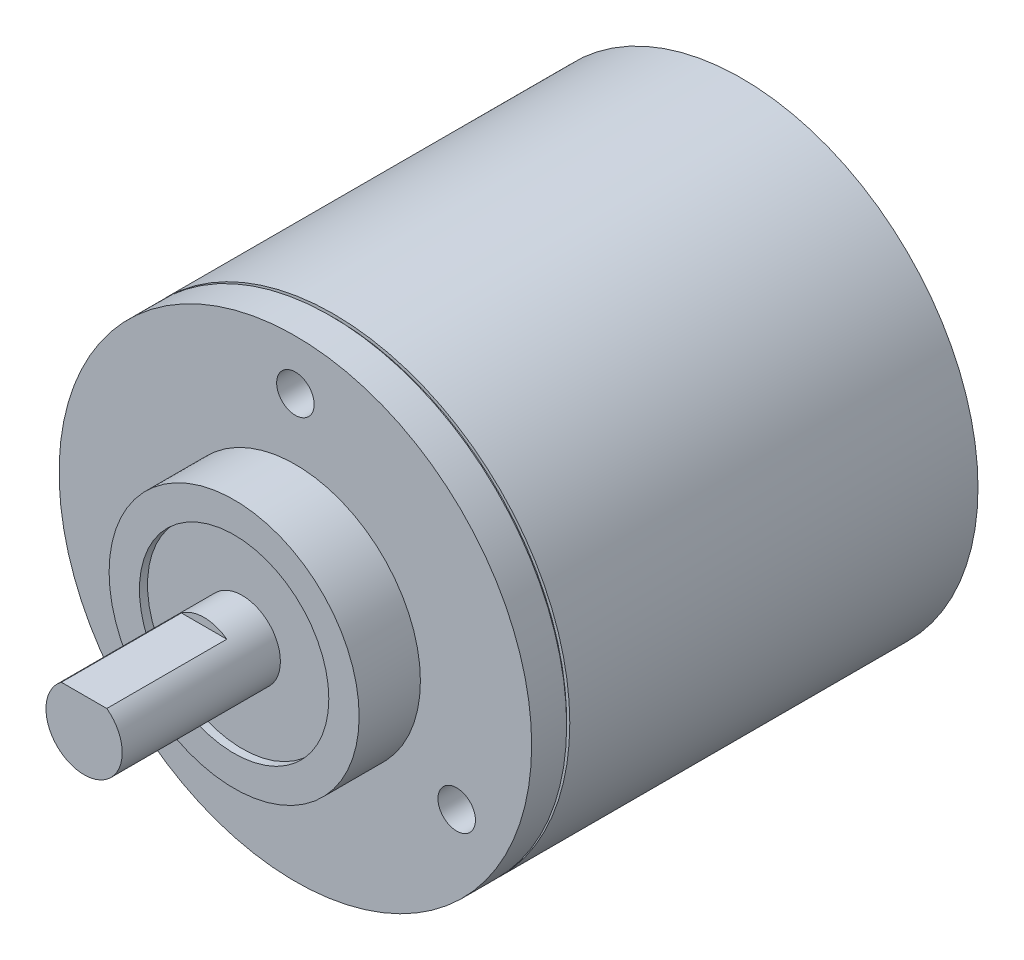
ISO-10303-21;
HEADER;
FILE_DESCRIPTION(('STEP AP214'),'2;1');
FILE_NAME('part.step','',(''),(''),'','','');
FILE_SCHEMA(('AUTOMOTIVE_DESIGN { 1 0 10303 214 1 1 1 1 }'));
ENDSEC;
DATA;
#1=APPLICATION_CONTEXT('core data for automotive mechanical design processes');
#2=APPLICATION_PROTOCOL_DEFINITION('international standard','automotive_design',2000,#1);
#3=PRODUCT_CONTEXT('',#1,'mechanical');
#4=PRODUCT('Part','Part','',(#3));
#5=PRODUCT_RELATED_PRODUCT_CATEGORY('part','',(#4));
#6=PRODUCT_DEFINITION_FORMATION('','',#4);
#7=PRODUCT_DEFINITION_CONTEXT('part definition',#1,'design');
#8=PRODUCT_DEFINITION('design','',#6,#7);
#9=PRODUCT_DEFINITION_SHAPE('','',#8);
#10=(LENGTH_UNIT() NAMED_UNIT(*) SI_UNIT(.MILLI.,.METRE.));
#11=(NAMED_UNIT(*) PLANE_ANGLE_UNIT() SI_UNIT($,.RADIAN.));
#12=(NAMED_UNIT(*) SI_UNIT($,.STERADIAN.) SOLID_ANGLE_UNIT());
#13=UNCERTAINTY_MEASURE_WITH_UNIT(LENGTH_MEASURE(1.E-05),#10,'distance_accuracy_value','');
#14=(GEOMETRIC_REPRESENTATION_CONTEXT(3) GLOBAL_UNCERTAINTY_ASSIGNED_CONTEXT((#13)) GLOBAL_UNIT_ASSIGNED_CONTEXT((#10,
#11,#12)) REPRESENTATION_CONTEXT('',''));
#15=CARTESIAN_POINT('',(0.,0.,0.));
#16=DIRECTION('',(0.,0.,1.));
#17=DIRECTION('',(1.,0.,0.));
#18=AXIS2_PLACEMENT_3D('',#15,#16,#17);
#19=CARTESIAN_POINT('',(0.,0.,-0.1));
#20=DIRECTION('',(0.,0.,1.));
#21=DIRECTION('',(1.,0.,0.));
#22=AXIS2_PLACEMENT_3D('',#19,#20,#21);
#23=CYLINDRICAL_SURFACE('',#22,18.9);
#24=CARTESIAN_POINT('',(0.,0.,32.8));
#25=DIRECTION('',(0.,0.,1.));
#26=DIRECTION('',(1.,0.,0.));
#27=AXIS2_PLACEMENT_3D('',#24,#25,#26);
#28=CIRCLE('',#27,18.9);
#29=CARTESIAN_POINT('',(18.9,0.,32.8));
#30=VERTEX_POINT('',#29);
#31=EDGE_CURVE('E40',#30,#30,#28,.F.);
#32=ORIENTED_EDGE('',*,*,#31,.F.);
#33=EDGE_LOOP('',(#32));
#34=FACE_BOUND('',#33,.T.);
#35=CARTESIAN_POINT('',(0.,0.,35.6));
#36=DIRECTION('',(0.,0.,1.));
#37=DIRECTION('',(1.,0.,0.));
#38=AXIS2_PLACEMENT_3D('',#35,#36,#37);
#39=CIRCLE('',#38,18.9);
#40=CARTESIAN_POINT('',(18.9,0.,35.6));
#41=VERTEX_POINT('',#40);
#42=EDGE_CURVE('E81',#41,#41,#39,.T.);
#43=ORIENTED_EDGE('',*,*,#42,.F.);
#44=EDGE_LOOP('',(#43));
#45=FACE_BOUND('',#44,.T.);
#46=ADVANCED_FACE('F36',(#34,#45),#23,.T.);
#47=CARTESIAN_POINT('',(0.,0.,35.6));
#48=DIRECTION('',(0.,0.,1.));
#49=DIRECTION('',(1.,0.,0.));
#50=AXIS2_PLACEMENT_3D('',#47,#48,#49);
#51=PLANE('',#50);
#52=CARTESIAN_POINT('',(-12.9037785163881,-7.45000000000006,35.6));
#53=DIRECTION('',(0.,0.,1.));
#54=DIRECTION('',(-0.500000000000004,0.866025403784436,0.));
#55=AXIS2_PLACEMENT_3D('',#52,#53,#54);
#56=CIRCLE('',#55,1.5);
#57=CARTESIAN_POINT('',(-13.6537785163881,-6.15096189432341,35.6));
#58=VERTEX_POINT('',#57);
#59=EDGE_CURVE('E114',#58,#58,#56,.T.);
#60=ORIENTED_EDGE('',*,*,#59,.F.);
#61=EDGE_LOOP('',(#60));
#62=FACE_BOUND('',#61,.T.);
#63=CARTESIAN_POINT('',(12.9037785163882,-7.44999999999988,35.6));
#64=DIRECTION('',(0.,0.,1.));
#65=DIRECTION('',(-0.499999999999992,-0.866025403784443,0.));
#66=AXIS2_PLACEMENT_3D('',#63,#64,#65);
#67=CIRCLE('',#66,1.5);
#68=CARTESIAN_POINT('',(12.1537785163882,-8.74903810567655,35.6));
#69=VERTEX_POINT('',#68);
#70=EDGE_CURVE('E103',#69,#69,#67,.T.);
#71=ORIENTED_EDGE('',*,*,#70,.F.);
#72=EDGE_LOOP('',(#71));
#73=FACE_BOUND('',#72,.T.);
#74=CARTESIAN_POINT('',(0.,14.9,35.6));
#75=DIRECTION('',(0.,0.,1.));
#76=DIRECTION('',(1.,0.,0.));
#77=AXIS2_PLACEMENT_3D('',#74,#75,#76);
#78=CIRCLE('',#77,1.5);
#79=CARTESIAN_POINT('',(1.5,14.9,35.6));
#80=VERTEX_POINT('',#79);
#81=EDGE_CURVE('E84',#80,#80,#78,.T.);
#82=ORIENTED_EDGE('',*,*,#81,.F.);
#83=EDGE_LOOP('',(#82));
#84=FACE_BOUND('',#83,.T.);
#85=CARTESIAN_POINT('',(0.,0.,35.6));
#86=DIRECTION('',(0.,0.,1.));
#87=DIRECTION('',(1.,0.,0.));
#88=AXIS2_PLACEMENT_3D('',#85,#86,#87);
#89=CIRCLE('',#88,10.);
#90=CARTESIAN_POINT('',(10.,0.,35.6));
#91=VERTEX_POINT('',#90);
#92=EDGE_CURVE('E88',#91,#91,#89,.T.);
#93=ORIENTED_EDGE('',*,*,#92,.F.);
#94=EDGE_LOOP('',(#93));
#95=FACE_BOUND('',#94,.T.);
#96=ORIENTED_EDGE('',*,*,#42,.T.);
#97=EDGE_LOOP('',(#96));
#98=FACE_BOUND('',#97,.T.);
#99=ADVANCED_FACE('F145',(#62,#73,#84,#95,#98),#51,.T.);
#100=CARTESIAN_POINT('',(0.,0.,40.5));
#101=DIRECTION('',(0.,0.,-1.));
#102=DIRECTION('',(-1.,0.,0.));
#103=AXIS2_PLACEMENT_3D('',#100,#101,#102);
#104=CYLINDRICAL_SURFACE('',#103,10.);
#105=CARTESIAN_POINT('',(0.,0.,40.5));
#106=DIRECTION('',(0.,0.,1.));
#107=DIRECTION('',(1.,0.,0.));
#108=AXIS2_PLACEMENT_3D('',#105,#106,#107);
#109=CIRCLE('',#108,10.);
#110=CARTESIAN_POINT('',(10.,0.,40.5));
#111=VERTEX_POINT('',#110);
#112=EDGE_CURVE('E77',#111,#111,#109,.T.);
#113=ORIENTED_EDGE('',*,*,#112,.F.);
#114=EDGE_LOOP('',(#113));
#115=FACE_BOUND('',#114,.T.);
#116=ORIENTED_EDGE('',*,*,#92,.T.);
#117=EDGE_LOOP('',(#116));
#118=FACE_BOUND('',#117,.T.);
#119=ADVANCED_FACE('F139',(#115,#118),#104,.T.);
#120=CARTESIAN_POINT('',(0.,0.,40.5));
#121=DIRECTION('',(0.,0.,1.));
#122=DIRECTION('',(1.,0.,0.));
#123=AXIS2_PLACEMENT_3D('',#120,#121,#122);
#124=PLANE('',#123);
#125=CARTESIAN_POINT('',(0.,0.,40.5));
#126=DIRECTION('',(0.,0.,1.));
#127=DIRECTION('',(1.,0.,0.));
#128=AXIS2_PLACEMENT_3D('',#125,#126,#127);
#129=CIRCLE('',#128,7.575);
#130=CARTESIAN_POINT('',(7.575,0.,40.5));
#131=VERTEX_POINT('',#130);
#132=EDGE_CURVE('E126',#131,#131,#129,.T.);
#133=ORIENTED_EDGE('',*,*,#132,.F.);
#134=EDGE_LOOP('',(#133));
#135=FACE_BOUND('',#134,.T.);
#136=ORIENTED_EDGE('',*,*,#112,.T.);
#137=EDGE_LOOP('',(#136));
#138=FACE_BOUND('',#137,.T.);
#139=ADVANCED_FACE('F135',(#135,#138),#124,.T.);
#140=CARTESIAN_POINT('',(0.,14.9,27.6));
#141=DIRECTION('',(0.,0.,1.));
#142=DIRECTION('',(1.,0.,0.));
#143=AXIS2_PLACEMENT_3D('',#140,#141,#142);
#144=CYLINDRICAL_SURFACE('',#143,1.5);
#145=CARTESIAN_POINT('',(0.,14.9,27.6));
#146=DIRECTION('',(0.,0.,1.));
#147=DIRECTION('',(1.,0.,0.));
#148=AXIS2_PLACEMENT_3D('',#145,#146,#147);
#149=CIRCLE('',#148,1.5);
#150=CARTESIAN_POINT('',(1.5,14.9,27.6));
#151=VERTEX_POINT('',#150);
#152=EDGE_CURVE('E78',#151,#151,#149,.T.);
#153=ORIENTED_EDGE('',*,*,#152,.F.);
#154=EDGE_LOOP('',(#153));
#155=FACE_BOUND('',#154,.T.);
#156=ORIENTED_EDGE('',*,*,#81,.T.);
#157=EDGE_LOOP('',(#156));
#158=FACE_BOUND('',#157,.T.);
#159=ADVANCED_FACE('F138',(#155,#158),#144,.F.);
#160=CARTESIAN_POINT('',(0.,14.9,27.6));
#161=DIRECTION('',(0.,0.,1.));
#162=DIRECTION('',(1.,0.,0.));
#163=AXIS2_PLACEMENT_3D('',#160,#161,#162);
#164=PLANE('',#163);
#165=ORIENTED_EDGE('',*,*,#152,.T.);
#166=EDGE_LOOP('',(#165));
#167=FACE_BOUND('',#166,.T.);
#168=ADVANCED_FACE('F183',(#167),#164,.T.);
#169=CARTESIAN_POINT('',(0.,0.,39.85));
#170=DIRECTION('',(0.,0.,1.));
#171=DIRECTION('',(1.,0.,0.));
#172=AXIS2_PLACEMENT_3D('',#169,#170,#171);
#173=CYLINDRICAL_SURFACE('',#172,7.575);
#174=CARTESIAN_POINT('',(0.,0.,39.85));
#175=DIRECTION('',(0.,0.,1.));
#176=DIRECTION('',(1.,0.,0.));
#177=AXIS2_PLACEMENT_3D('',#174,#175,#176);
#178=CIRCLE('',#177,7.575);
#179=CARTESIAN_POINT('',(7.575,0.,39.85));
#180=VERTEX_POINT('',#179);
#181=EDGE_CURVE('E127',#180,#180,#178,.T.);
#182=ORIENTED_EDGE('',*,*,#181,.F.);
#183=EDGE_LOOP('',(#182));
#184=FACE_BOUND('',#183,.T.);
#185=ORIENTED_EDGE('',*,*,#132,.T.);
#186=EDGE_LOOP('',(#185));
#187=FACE_BOUND('',#186,.T.);
#188=ADVANCED_FACE('F133',(#184,#187),#173,.F.);
#189=CARTESIAN_POINT('',(0.,0.,39.85));
#190=DIRECTION('',(0.,0.,1.));
#191=DIRECTION('',(1.,0.,0.));
#192=AXIS2_PLACEMENT_3D('',#189,#190,#191);
#193=PLANE('',#192);
#194=CARTESIAN_POINT('',(0.,0.,39.85));
#195=DIRECTION('',(0.,0.,1.));
#196=DIRECTION('',(1.,0.,0.));
#197=AXIS2_PLACEMENT_3D('',#194,#195,#196);
#198=CIRCLE('',#197,3.05);
#199=CARTESIAN_POINT('',(3.05,0.,39.85));
#200=VERTEX_POINT('',#199);
#201=EDGE_CURVE('E122',#200,#200,#198,.T.);
#202=ORIENTED_EDGE('',*,*,#201,.F.);
#203=EDGE_LOOP('',(#202));
#204=FACE_BOUND('',#203,.T.);
#205=ORIENTED_EDGE('',*,*,#181,.T.);
#206=EDGE_LOOP('',(#205));
#207=FACE_BOUND('',#206,.T.);
#208=ADVANCED_FACE('F180',(#204,#207),#193,.T.);
#209=CARTESIAN_POINT('',(0.,0.,52.5));
#210=DIRECTION('',(0.,0.,1.));
#211=DIRECTION('',(1.,0.,0.));
#212=AXIS2_PLACEMENT_3D('',#209,#210,#211);
#213=PLANE('',#212);
#214=DIRECTION('',(1.,0.,0.));
#215=VECTOR('',#214,1.);
#216=CARTESIAN_POINT('',(-4.31706966346971,2.45,52.5));
#217=LINE('',#216,#215);
#218=CARTESIAN_POINT('',(-1.81659021245849,2.45,52.5));
#219=VERTEX_POINT('',#218);
#220=CARTESIAN_POINT('',(1.81659021245849,2.45,52.5));
#221=VERTEX_POINT('',#220);
#222=EDGE_CURVE('E65',#219,#221,#217,.T.);
#223=ORIENTED_EDGE('',*,*,#222,.F.);
#224=CARTESIAN_POINT('',(0.,0.,52.5));
#225=DIRECTION('',(0.,0.,1.));
#226=DIRECTION('',(1.,0.,0.));
#227=AXIS2_PLACEMENT_3D('',#224,#225,#226);
#228=CIRCLE('',#227,3.05);
#229=EDGE_CURVE('E72',#219,#221,#228,.T.);
#230=ORIENTED_EDGE('',*,*,#229,.T.);
#231=EDGE_LOOP('',(#223,#230));
#232=FACE_BOUND('',#231,.T.);
#233=ADVANCED_FACE('F71',(#232),#213,.T.);
#234=CARTESIAN_POINT('',(0.,0.,52.5));
#235=DIRECTION('',(0.,0.,-1.));
#236=DIRECTION('',(-1.,0.,0.));
#237=AXIS2_PLACEMENT_3D('',#234,#235,#236);
#238=CYLINDRICAL_SURFACE('',#237,3.05);
#239=ORIENTED_EDGE('',*,*,#229,.F.);
#240=DIRECTION('',(0.,0.,-1.));
#241=VECTOR('',#240,1.);
#242=CARTESIAN_POINT('',(-1.81659021245849,2.45,52.5));
#243=LINE('',#242,#241);
#244=CARTESIAN_POINT('',(-1.81659021245849,2.45,42.9));
#245=VERTEX_POINT('',#244);
#246=EDGE_CURVE('E11',#219,#245,#243,.T.);
#247=ORIENTED_EDGE('',*,*,#246,.T.);
#248=CARTESIAN_POINT('',(0.,0.,42.9));
#249=DIRECTION('',(0.,0.,1.));
#250=DIRECTION('',(1.,0.,0.));
#251=AXIS2_PLACEMENT_3D('',#248,#249,#250);
#252=CIRCLE('',#251,3.05);
#253=CARTESIAN_POINT('',(1.81659021245849,2.45,42.9));
#254=VERTEX_POINT('',#253);
#255=EDGE_CURVE('E56',#254,#245,#252,.T.);
#256=ORIENTED_EDGE('',*,*,#255,.F.);
#257=DIRECTION('',(0.,0.,-1.));
#258=VECTOR('',#257,1.);
#259=CARTESIAN_POINT('',(1.81659021245849,2.45,52.5));
#260=LINE('',#259,#258);
#261=EDGE_CURVE('E45',#254,#221,#260,.F.);
#262=ORIENTED_EDGE('',*,*,#261,.T.);
#263=EDGE_LOOP('',(#239,#247,#256,#262));
#264=FACE_BOUND('',#263,.T.);
#265=ORIENTED_EDGE('',*,*,#201,.T.);
#266=EDGE_LOOP('',(#265));
#267=FACE_BOUND('',#266,.T.);
#268=ADVANCED_FACE('F75',(#264,#267),#238,.T.);
#269=CARTESIAN_POINT('',(-4.31706966346971,2.45,42.9));
#270=DIRECTION('',(0.,-1.,0.));
#271=DIRECTION('',(0.,0.,-1.));
#272=AXIS2_PLACEMENT_3D('',#269,#270,#271);
#273=PLANE('',#272);
#274=ORIENTED_EDGE('',*,*,#222,.T.);
#275=ORIENTED_EDGE('',*,*,#261,.F.);
#276=DIRECTION('',(1.,0.,0.));
#277=VECTOR('',#276,1.);
#278=CARTESIAN_POINT('',(-4.31706966346971,2.45,42.9));
#279=LINE('',#278,#277);
#280=EDGE_CURVE('E52',#245,#254,#279,.T.);
#281=ORIENTED_EDGE('',*,*,#280,.F.);
#282=ORIENTED_EDGE('',*,*,#246,.F.);
#283=EDGE_LOOP('',(#274,#275,#281,#282));
#284=FACE_BOUND('',#283,.T.);
#285=ADVANCED_FACE('F64',(#284),#273,.F.);
#286=CARTESIAN_POINT('',(0.,0.,42.9));
#287=DIRECTION('',(0.,0.,1.));
#288=DIRECTION('',(1.,0.,0.));
#289=AXIS2_PLACEMENT_3D('',#286,#287,#288);
#290=PLANE('',#289);
#291=ORIENTED_EDGE('',*,*,#255,.T.);
#292=ORIENTED_EDGE('',*,*,#280,.T.);
#293=EDGE_LOOP('',(#291,#292));
#294=FACE_BOUND('',#293,.T.);
#295=ADVANCED_FACE('F196',(#294),#290,.T.);
#296=CARTESIAN_POINT('',(12.9037785163882,-7.44999999999988,27.6));
#297=DIRECTION('',(0.,0.,1.));
#298=DIRECTION('',(1.,0.,0.));
#299=AXIS2_PLACEMENT_3D('',#296,#297,#298);
#300=CYLINDRICAL_SURFACE('',#299,1.5);
#301=CARTESIAN_POINT('',(12.9037785163882,-7.44999999999988,27.6));
#302=DIRECTION('',(0.,0.,1.));
#303=DIRECTION('',(-0.499999999999992,-0.866025403784443,0.));
#304=AXIS2_PLACEMENT_3D('',#301,#302,#303);
#305=CIRCLE('',#304,1.5);
#306=CARTESIAN_POINT('',(12.1537785163882,-8.74903810567655,27.6));
#307=VERTEX_POINT('',#306);
#308=EDGE_CURVE('E117',#307,#307,#305,.T.);
#309=ORIENTED_EDGE('',*,*,#308,.F.);
#310=EDGE_LOOP('',(#309));
#311=FACE_BOUND('',#310,.T.);
#312=ORIENTED_EDGE('',*,*,#70,.T.);
#313=EDGE_LOOP('',(#312));
#314=FACE_BOUND('',#313,.T.);
#315=ADVANCED_FACE('F199',(#311,#314),#300,.F.);
#316=CARTESIAN_POINT('',(12.9037785163882,-7.44999999999988,27.6));
#317=DIRECTION('',(0.,0.,1.));
#318=DIRECTION('',(-0.499999999999992,-0.866025403784443,0.));
#319=AXIS2_PLACEMENT_3D('',#316,#317,#318);
#320=PLANE('',#319);
#321=ORIENTED_EDGE('',*,*,#308,.T.);
#322=EDGE_LOOP('',(#321));
#323=FACE_BOUND('',#322,.T.);
#324=ADVANCED_FACE('F202',(#323),#320,.T.);
#325=CARTESIAN_POINT('',(-12.9037785163881,-7.45000000000006,27.6));
#326=DIRECTION('',(0.,0.,1.));
#327=DIRECTION('',(1.,0.,0.));
#328=AXIS2_PLACEMENT_3D('',#325,#326,#327);
#329=CYLINDRICAL_SURFACE('',#328,1.5);
#330=CARTESIAN_POINT('',(-12.9037785163881,-7.45000000000006,27.6));
#331=DIRECTION('',(0.,0.,1.));
#332=DIRECTION('',(-0.500000000000004,0.866025403784436,0.));
#333=AXIS2_PLACEMENT_3D('',#330,#331,#332);
#334=CIRCLE('',#333,1.5);
#335=CARTESIAN_POINT('',(-13.6537785163881,-6.15096189432341,27.6));
#336=VERTEX_POINT('',#335);
#337=EDGE_CURVE('E73',#336,#336,#334,.T.);
#338=ORIENTED_EDGE('',*,*,#337,.F.);
#339=EDGE_LOOP('',(#338));
#340=FACE_BOUND('',#339,.T.);
#341=ORIENTED_EDGE('',*,*,#59,.T.);
#342=EDGE_LOOP('',(#341));
#343=FACE_BOUND('',#342,.T.);
#344=ADVANCED_FACE('F206',(#340,#343),#329,.F.);
#345=CARTESIAN_POINT('',(-12.9037785163881,-7.45000000000006,27.6));
#346=DIRECTION('',(0.,0.,1.));
#347=DIRECTION('',(-0.500000000000004,0.866025403784436,0.));
#348=AXIS2_PLACEMENT_3D('',#345,#346,#347);
#349=PLANE('',#348);
#350=ORIENTED_EDGE('',*,*,#337,.T.);
#351=EDGE_LOOP('',(#350));
#352=FACE_BOUND('',#351,.T.);
#353=ADVANCED_FACE('F210',(#352),#349,.T.);
#354=CARTESIAN_POINT('',(0.,21.8461649379907,32.8));
#355=DIRECTION('',(0.,0.,1.));
#356=DIRECTION('',(1.,0.,0.));
#357=AXIS2_PLACEMENT_3D('',#354,#355,#356);
#358=PLANE('',#357);
#359=ORIENTED_EDGE('',*,*,#31,.T.);
#360=EDGE_LOOP('',(#359));
#361=FACE_BOUND('',#360,.T.);
#362=CARTESIAN_POINT('',(0.,0.,32.8));
#363=DIRECTION('',(0.,0.,-1.));
#364=DIRECTION('',(-1.,0.,0.));
#365=AXIS2_PLACEMENT_3D('',#362,#363,#364);
#366=CIRCLE('',#365,18.65);
#367=CARTESIAN_POINT('',(-18.65,0.,32.8));
#368=VERTEX_POINT('',#367);
#369=EDGE_CURVE('E99',#368,#368,#366,.T.);
#370=ORIENTED_EDGE('',*,*,#369,.F.);
#371=EDGE_LOOP('',(#370));
#372=FACE_BOUND('',#371,.T.);
#373=ADVANCED_FACE('F214',(#361,#372),#358,.F.);
#374=CARTESIAN_POINT('',(0.,0.,-0.1));
#375=DIRECTION('',(0.,0.,-1.));
#376=DIRECTION('',(-1.,0.,0.));
#377=AXIS2_PLACEMENT_3D('',#374,#375,#376);
#378=CYLINDRICAL_SURFACE('',#377,18.65);
#379=CARTESIAN_POINT('',(0.,0.,32.55));
#380=DIRECTION('',(0.,0.,-1.));
#381=DIRECTION('',(-1.,0.,0.));
#382=AXIS2_PLACEMENT_3D('',#379,#380,#381);
#383=CIRCLE('',#382,18.65);
#384=CARTESIAN_POINT('',(-18.65,0.,32.55));
#385=VERTEX_POINT('',#384);
#386=EDGE_CURVE('E105',#385,#385,#383,.T.);
#387=ORIENTED_EDGE('',*,*,#386,.F.);
#388=EDGE_LOOP('',(#387));
#389=FACE_BOUND('',#388,.T.);
#390=ORIENTED_EDGE('',*,*,#369,.T.);
#391=EDGE_LOOP('',(#390));
#392=FACE_BOUND('',#391,.T.);
#393=ADVANCED_FACE('F173',(#389,#392),#378,.T.);
#394=CARTESIAN_POINT('',(0.,21.8461649379907,32.55));
#395=DIRECTION('',(0.,0.,-1.));
#396=DIRECTION('',(-1.,0.,0.));
#397=AXIS2_PLACEMENT_3D('',#394,#395,#396);
#398=PLANE('',#397);
#399=CARTESIAN_POINT('',(0.,0.,32.55));
#400=DIRECTION('',(0.,0.,-1.));
#401=DIRECTION('',(-1.,0.,0.));
#402=AXIS2_PLACEMENT_3D('',#399,#400,#401);
#403=CIRCLE('',#402,18.9);
#404=CARTESIAN_POINT('',(-18.9,0.,32.55));
#405=VERTEX_POINT('',#404);
#406=EDGE_CURVE('E97',#405,#405,#403,.F.);
#407=ORIENTED_EDGE('',*,*,#406,.T.);
#408=EDGE_LOOP('',(#407));
#409=FACE_BOUND('',#408,.T.);
#410=ORIENTED_EDGE('',*,*,#386,.T.);
#411=EDGE_LOOP('',(#410));
#412=FACE_BOUND('',#411,.T.);
#413=ADVANCED_FACE('F166',(#409,#412),#398,.F.);
#414=CARTESIAN_POINT('',(0.,0.,-0.1));
#415=DIRECTION('',(0.,0.,1.));
#416=DIRECTION('',(1.,0.,0.));
#417=AXIS2_PLACEMENT_3D('',#414,#415,#416);
#418=PLANE('',#417);
#419=CARTESIAN_POINT('',(0.,0.,-0.1));
#420=DIRECTION('',(0.,0.,1.));
#421=DIRECTION('',(1.,0.,0.));
#422=AXIS2_PLACEMENT_3D('',#419,#420,#421);
#423=CIRCLE('',#422,18.9);
#424=CARTESIAN_POINT('',(18.9,0.,-0.1));
#425=VERTEX_POINT('',#424);
#426=EDGE_CURVE('E91',#425,#425,#423,.T.);
#427=ORIENTED_EDGE('',*,*,#426,.F.);
#428=EDGE_LOOP('',(#427));
#429=FACE_BOUND('',#428,.T.);
#430=ADVANCED_FACE('F161',(#429),#418,.F.);
#431=ORIENTED_EDGE('',*,*,#406,.F.);
#432=EDGE_LOOP('',(#431));
#433=FACE_BOUND('',#432,.T.);
#434=ORIENTED_EDGE('',*,*,#426,.T.);
#435=EDGE_LOOP('',(#434));
#436=FACE_BOUND('',#435,.T.);
#437=ADVANCED_FACE('F38',(#433,#436),#23,.T.);
#438=CLOSED_SHELL('',(#46,#99,#119,#139,#159,#168,#188,#208,#233,#268,#285,#295,#315,#324,#344,
#353,#373,#393,#413,#430,#437));
#439=MANIFOLD_SOLID_BREP('B2',#438);
#440=ADVANCED_BREP_SHAPE_REPRESENTATION('',(#18,#439),#14);
#441=SHAPE_DEFINITION_REPRESENTATION(#9,#440);
ENDSEC;
END-ISO-10303-21;
